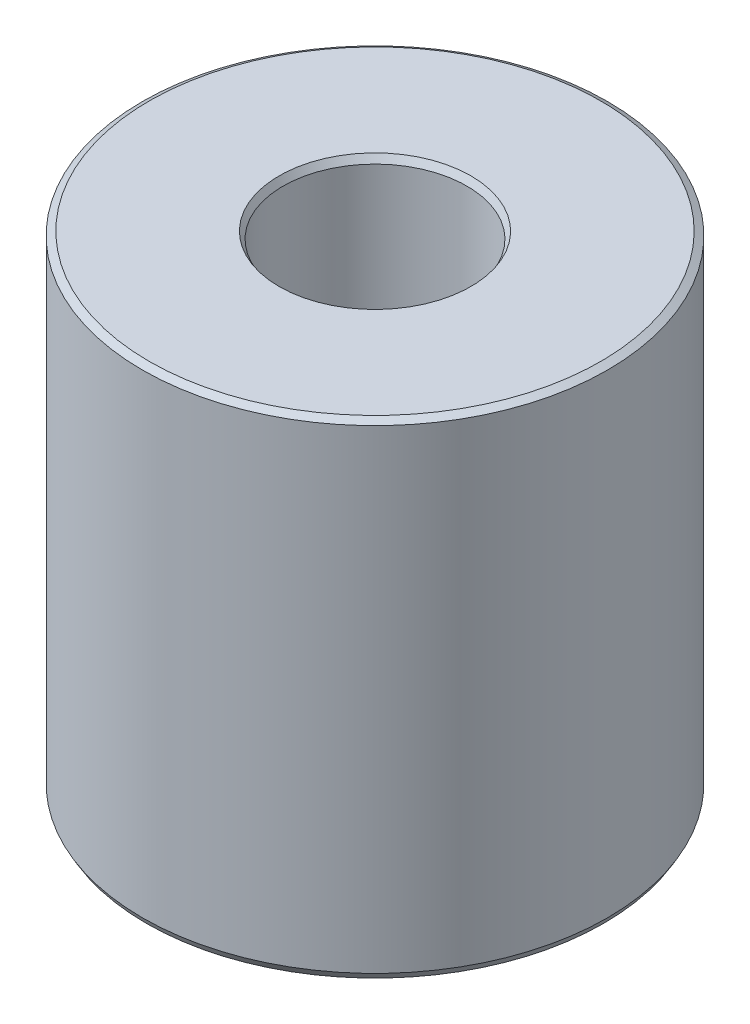
ISO-10303-21;
HEADER;
FILE_DESCRIPTION(('STEP AP214'),'2;1');
FILE_NAME('part.step','',(''),(''),'','','');
FILE_SCHEMA(('AUTOMOTIVE_DESIGN { 1 0 10303 214 1 1 1 1 }'));
ENDSEC;
DATA;
#1=APPLICATION_CONTEXT('core data for automotive mechanical design processes');
#2=APPLICATION_PROTOCOL_DEFINITION('international standard','automotive_design',2000,#1);
#3=PRODUCT_CONTEXT('',#1,'mechanical');
#4=PRODUCT('Part','Part','',(#3));
#5=PRODUCT_RELATED_PRODUCT_CATEGORY('part','',(#4));
#6=PRODUCT_DEFINITION_FORMATION('','',#4);
#7=PRODUCT_DEFINITION_CONTEXT('part definition',#1,'design');
#8=PRODUCT_DEFINITION('design','',#6,#7);
#9=PRODUCT_DEFINITION_SHAPE('','',#8);
#10=(LENGTH_UNIT() NAMED_UNIT(*) SI_UNIT(.MILLI.,.METRE.));
#11=(NAMED_UNIT(*) PLANE_ANGLE_UNIT() SI_UNIT($,.RADIAN.));
#12=(NAMED_UNIT(*) SI_UNIT($,.STERADIAN.) SOLID_ANGLE_UNIT());
#13=UNCERTAINTY_MEASURE_WITH_UNIT(LENGTH_MEASURE(1.E-05),#10,'distance_accuracy_value','');
#14=(GEOMETRIC_REPRESENTATION_CONTEXT(3) GLOBAL_UNCERTAINTY_ASSIGNED_CONTEXT((#13)) GLOBAL_UNIT_ASSIGNED_CONTEXT((#10,
#11,#12)) REPRESENTATION_CONTEXT('',''));
#15=CARTESIAN_POINT('',(0.,0.,0.));
#16=DIRECTION('',(0.,0.,1.));
#17=DIRECTION('',(1.,0.,0.));
#18=AXIS2_PLACEMENT_3D('',#15,#16,#17);
#19=CARTESIAN_POINT('',(0.,104.319641530417,0.));
#20=DIRECTION('',(0.,-1.,0.));
#21=DIRECTION('',(0.,0.,-1.));
#22=AXIS2_PLACEMENT_3D('',#19,#20,#21);
#23=CYLINDRICAL_SURFACE('',#22,50.);
#24=CARTESIAN_POINT('',(0.,1.47892764168507,0.));
#25=DIRECTION('',(0.,1.,0.));
#26=DIRECTION('',(0.,0.,1.));
#27=AXIS2_PLACEMENT_3D('',#24,#25,#26);
#28=CIRCLE('',#27,50.);
#29=CARTESIAN_POINT('',(0.,1.47892764168507,50.));
#30=VERTEX_POINT('',#29);
#31=EDGE_CURVE('E10',#30,#30,#28,.T.);
#32=ORIENTED_EDGE('',*,*,#31,.T.);
#33=EDGE_LOOP('',(#32));
#34=FACE_BOUND('',#33,.T.);
#35=CARTESIAN_POINT('',(0.,103.465782258378,0.));
#36=DIRECTION('',(0.,1.,0.));
#37=DIRECTION('',(0.,0.,1.));
#38=AXIS2_PLACEMENT_3D('',#35,#36,#37);
#39=CIRCLE('',#38,50.);
#40=CARTESIAN_POINT('',(0.,103.465782258378,50.));
#41=VERTEX_POINT('',#40);
#42=EDGE_CURVE('E50',#41,#41,#39,.F.);
#43=ORIENTED_EDGE('',*,*,#42,.T.);
#44=EDGE_LOOP('',(#43));
#45=FACE_BOUND('',#44,.T.);
#46=ADVANCED_FACE('F39',(#34,#45),#23,.T.);
#47=CARTESIAN_POINT('',(0.,104.319641530417,0.));
#48=DIRECTION('',(0.,1.,0.));
#49=DIRECTION('',(0.,0.,1.));
#50=AXIS2_PLACEMENT_3D('',#47,#48,#49);
#51=PLANE('',#50);
#52=CARTESIAN_POINT('',(0.,104.319641530417,0.));
#53=DIRECTION('',(0.,1.,0.));
#54=DIRECTION('',(0.,0.,1.));
#55=AXIS2_PLACEMENT_3D('',#52,#53,#54);
#56=CIRCLE('',#55,20.6178002502134);
#57=CARTESIAN_POINT('',(0.,104.319641530417,20.6178002502134));
#58=VERTEX_POINT('',#57);
#59=EDGE_CURVE('E58',#58,#58,#56,.F.);
#60=ORIENTED_EDGE('',*,*,#59,.T.);
#61=EDGE_LOOP('',(#60));
#62=FACE_BOUND('',#61,.T.);
#63=CARTESIAN_POINT('',(0.,104.319641530417,0.));
#64=DIRECTION('',(0.,1.,0.));
#65=DIRECTION('',(0.,0.,1.));
#66=AXIS2_PLACEMENT_3D('',#63,#64,#65);
#67=CIRCLE('',#66,48.5210723583149);
#68=CARTESIAN_POINT('',(0.,104.319641530417,48.5210723583149));
#69=VERTEX_POINT('',#68);
#70=EDGE_CURVE('E61',#69,#69,#67,.T.);
#71=ORIENTED_EDGE('',*,*,#70,.T.);
#72=EDGE_LOOP('',(#71));
#73=FACE_BOUND('',#72,.T.);
#74=ADVANCED_FACE('F88',(#62,#73),#51,.T.);
#75=CARTESIAN_POINT('',(0.,0.,0.));
#76=DIRECTION('',(0.,1.,0.));
#77=DIRECTION('',(0.,0.,1.));
#78=AXIS2_PLACEMENT_3D('',#75,#76,#77);
#79=PLANE('',#78);
#80=CARTESIAN_POINT('',(0.,0.,0.));
#81=DIRECTION('',(0.,1.,0.));
#82=DIRECTION('',(0.,0.,1.));
#83=AXIS2_PLACEMENT_3D('',#80,#81,#82);
#84=CIRCLE('',#83,21.2428686198596);
#85=CARTESIAN_POINT('',(0.,0.,21.2428686198596));
#86=VERTEX_POINT('',#85);
#87=EDGE_CURVE('E51',#86,#86,#84,.T.);
#88=ORIENTED_EDGE('',*,*,#87,.T.);
#89=EDGE_LOOP('',(#88));
#90=FACE_BOUND('',#89,.T.);
#91=CARTESIAN_POINT('',(0.,0.,0.));
#92=DIRECTION('',(0.,1.,0.));
#93=DIRECTION('',(0.,0.,1.));
#94=AXIS2_PLACEMENT_3D('',#91,#92,#93);
#95=CIRCLE('',#94,49.1461407279611);
#96=CARTESIAN_POINT('',(0.,0.,49.1461407279611));
#97=VERTEX_POINT('',#96);
#98=EDGE_CURVE('E54',#97,#97,#95,.F.);
#99=ORIENTED_EDGE('',*,*,#98,.T.);
#100=EDGE_LOOP('',(#99));
#101=FACE_BOUND('',#100,.T.);
#102=ADVANCED_FACE('F83',(#90,#101),#79,.F.);
#103=CARTESIAN_POINT('',(0.,104.319641530417,0.));
#104=DIRECTION('',(0.,-1.,0.));
#105=DIRECTION('',(0.,0.,-1.));
#106=AXIS2_PLACEMENT_3D('',#103,#104,#105);
#107=CYLINDRICAL_SURFACE('',#106,19.7639409781745);
#108=CARTESIAN_POINT('',(0.,102.840713888732,0.));
#109=DIRECTION('',(0.,1.,0.));
#110=DIRECTION('',(0.,0.,1.));
#111=AXIS2_PLACEMENT_3D('',#108,#109,#110);
#112=CIRCLE('',#111,19.7639409781745);
#113=CARTESIAN_POINT('',(0.,102.840713888732,19.7639409781745));
#114=VERTEX_POINT('',#113);
#115=EDGE_CURVE('E67',#114,#114,#112,.T.);
#116=ORIENTED_EDGE('',*,*,#115,.T.);
#117=EDGE_LOOP('',(#116));
#118=FACE_BOUND('',#117,.T.);
#119=CARTESIAN_POINT('',(0.,0.853859272038876,0.));
#120=DIRECTION('',(0.,1.,0.));
#121=DIRECTION('',(0.,0.,1.));
#122=AXIS2_PLACEMENT_3D('',#119,#120,#121);
#123=CIRCLE('',#122,19.7639409781745);
#124=CARTESIAN_POINT('',(0.,0.853859272038876,19.7639409781745));
#125=VERTEX_POINT('',#124);
#126=EDGE_CURVE('E69',#125,#125,#123,.F.);
#127=ORIENTED_EDGE('',*,*,#126,.T.);
#128=EDGE_LOOP('',(#127));
#129=FACE_BOUND('',#128,.T.);
#130=ADVANCED_FACE('F71',(#118,#129),#107,.F.);
#131=CARTESIAN_POINT('',(0.,102.840713888732,0.));
#132=DIRECTION('',(0.,1.,0.));
#133=DIRECTION('',(0.,0.,1.));
#134=AXIS2_PLACEMENT_3D('',#131,#132,#133);
#135=CONICAL_SURFACE('',#134,19.7639409781745,0.523598775598298);
#136=CARTESIAN_POINT('',(0.,104.319641530417,20.6178002502134));
#137=CARTESIAN_POINT('',(0.,104.30423603415,20.6089058827963));
#138=CARTESIAN_POINT('',(0.,104.288830537882,20.6000115153793));
#139=CARTESIAN_POINT('',(0.,104.258019545347,20.5822227805451));
#140=CARTESIAN_POINT('',(0.,104.242614049079,20.5733284131281));
#141=CARTESIAN_POINT('',(0.,104.211803056544,20.5555396782939));
#142=CARTESIAN_POINT('',(0.,104.196397560277,20.5466453108768));
#143=CARTESIAN_POINT('',(0.,104.165586567742,20.5288565760427));
#144=CARTESIAN_POINT('',(0.,104.150181071474,20.5199622086256));
#145=CARTESIAN_POINT('',(0.,104.119370078939,20.5021734737915));
#146=CARTESIAN_POINT('',(0.,104.103964582672,20.4932791063744));
#147=CARTESIAN_POINT('',(0.,104.073153590136,20.4754903715403));
#148=CARTESIAN_POINT('',(0.,104.057748093869,20.4665960041232));
#149=CARTESIAN_POINT('',(0.,104.026937101334,20.4488072692891));
#150=CARTESIAN_POINT('',(0.,104.011531605066,20.439912901872));
#151=CARTESIAN_POINT('',(0.,103.980720612531,20.4221241670378));
#152=CARTESIAN_POINT('',(0.,103.965315116264,20.4132297996208));
#153=CARTESIAN_POINT('',(0.,103.934504123728,20.3954410647866));
#154=CARTESIAN_POINT('',(0.,103.919098627461,20.3865466973696));
#155=CARTESIAN_POINT('',(0.,103.888287634926,20.3687579625354));
#156=CARTESIAN_POINT('',(0.,103.872882138658,20.3598635951183));
#157=CARTESIAN_POINT('',(0.,103.842071146123,20.3420748602842));
#158=CARTESIAN_POINT('',(0.,103.826665649856,20.3331804928671));
#159=CARTESIAN_POINT('',(0.,103.79585465732,20.315391758033));
#160=CARTESIAN_POINT('',(0.,103.780449161053,20.3064973906159));
#161=CARTESIAN_POINT('',(0.,103.749638168518,20.2887086557818));
#162=CARTESIAN_POINT('',(0.,103.73423267225,20.2798142883647));
#163=CARTESIAN_POINT('',(0.,103.703421679715,20.2620255535306));
#164=CARTESIAN_POINT('',(0.,103.688016183448,20.2531311861135));
#165=CARTESIAN_POINT('',(0.,103.657205190912,20.2353424512793));
#166=CARTESIAN_POINT('',(0.,103.641799694645,20.2264480838623));
#167=CARTESIAN_POINT('',(0.,103.61098870211,20.2086593490281));
#168=CARTESIAN_POINT('',(0.,103.595583205842,20.199764981611));
#169=CARTESIAN_POINT('',(0.,103.564772213307,20.1819762467769));
#170=CARTESIAN_POINT('',(0.,103.54936671704,20.1730818793598));
#171=CARTESIAN_POINT('',(0.,103.518555724504,20.1552931445257));
#172=CARTESIAN_POINT('',(0.,103.503150228237,20.1463987771086));
#173=CARTESIAN_POINT('',(0.,103.472339235702,20.1286100422745));
#174=CARTESIAN_POINT('',(0.,103.456933739434,20.1197156748574));
#175=CARTESIAN_POINT('',(0.,103.426122746899,20.1019269400233));
#176=CARTESIAN_POINT('',(0.,103.410717250632,20.0930325726062));
#177=CARTESIAN_POINT('',(0.,103.379906258096,20.075243837772));
#178=CARTESIAN_POINT('',(0.,103.364500761829,20.066349470355));
#179=CARTESIAN_POINT('',(0.,103.333689769294,20.0485607355208));
#180=CARTESIAN_POINT('',(0.,103.318284273026,20.0396663681038));
#181=CARTESIAN_POINT('',(0.,103.287473280491,20.0218776332696));
#182=CARTESIAN_POINT('',(0.,103.272067784224,20.0129832658525));
#183=CARTESIAN_POINT('',(0.,103.241256791689,19.9951945310184));
#184=CARTESIAN_POINT('',(0.,103.225851295421,19.9863001636013));
#185=CARTESIAN_POINT('',(0.,103.195040302886,19.9685114287672));
#186=CARTESIAN_POINT('',(0.,103.179634806618,19.9596170613501));
#187=CARTESIAN_POINT('',(0.,103.148823814083,19.941828326516));
#188=CARTESIAN_POINT('',(0.,103.133418317816,19.9329339590989));
#189=CARTESIAN_POINT('',(0.,103.102607325281,19.9151452242647));
#190=CARTESIAN_POINT('',(0.,103.087201829013,19.9062508568477));
#191=CARTESIAN_POINT('',(0.,103.056390836478,19.8884621220135));
#192=CARTESIAN_POINT('',(0.,103.04098534021,19.8795677545965));
#193=CARTESIAN_POINT('',(0.,103.010174347675,19.8617790197623));
#194=CARTESIAN_POINT('',(0.,102.994768851408,19.8528846523452));
#195=CARTESIAN_POINT('',(0.,102.963957858873,19.8350959175111));
#196=CARTESIAN_POINT('',(0.,102.948552362605,19.826201550094));
#197=CARTESIAN_POINT('',(0.,102.91774137007,19.8084128152599));
#198=CARTESIAN_POINT('',(0.,102.902335873802,19.7995184478428));
#199=CARTESIAN_POINT('',(0.,102.871524881267,19.7817297130087));
#200=CARTESIAN_POINT('',(0.,102.856119385,19.7728353455916));
#201=CARTESIAN_POINT('',(0.,102.840713888732,19.7639409781745));
#202=B_SPLINE_CURVE_WITH_KNOTS('',3,(#136,#137,#138,#139,#140,#141,#142,#143,#144,#145,#146,
#147,#148,#149,#150,#151,#152,#153,#154,#155,#156,#157,#158,#159,#160,#161,#162,#163,#164,#165,
#166,#167,#168,#169,#170,#171,#172,#173,#174,#175,#176,#177,#178,#179,#180,#181,#182,#183,#184,
#185,#186,#187,#188,#189,#190,#191,#192,#193,#194,#195,#196,#197,#198,#199,#200,#201),
.UNSPECIFIED.,.F.,.F.,(4,2,2,2,2,2,2,2,2,2,2,2,2,2,2,2,2,2,2,2,2,2,2,2,2,2,2,2,2,2,2,2,4),(0.,
0.0533662045024372,0.106732409004873,0.160098613507296,0.213464818009733,0.266831022512157,
0.320197227014594,0.373563431517017,0.426929636019453,0.48029584052189,0.533662045024313,
0.58702824952675,0.640394454029174,0.693760658531609,0.747126863034034,0.80049306753647,
0.853859272038895,0.90722547654133,0.960591681043766,1.01395788554619,1.06732409004863,
1.12069029455105,1.17405649905349,1.22742270355591,1.28078890805835,1.33415511256078,
1.38752131706321,1.44088752156564,1.49425372606807,1.5476199305705,1.60098613507293,
1.65435233957536,1.70771854407779),.UNSPECIFIED.);
#203=EDGE_CURVE('BSEAM77',#58,#114,#202,.T.);
#204=ORIENTED_EDGE('',*,*,#59,.F.);
#205=ORIENTED_EDGE('',*,*,#115,.F.);
#206=ORIENTED_EDGE('',*,*,#203,.T.);
#207=ORIENTED_EDGE('',*,*,#203,.F.);
#208=EDGE_LOOP('',(#204,#206,#205,#207));
#209=FACE_BOUND('',#208,.T.);
#210=ADVANCED_FACE('F77',(#209),#135,.F.);
#211=CARTESIAN_POINT('',(0.,0.,0.));
#212=DIRECTION('',(0.,-1.,0.));
#213=DIRECTION('',(0.,0.,-1.));
#214=AXIS2_PLACEMENT_3D('',#211,#212,#213);
#215=CONICAL_SURFACE('',#214,21.2428686198596,1.0471975511966);
#216=ORIENTED_EDGE('',*,*,#126,.F.);
#217=EDGE_LOOP('',(#216));
#218=FACE_BOUND('',#217,.T.);
#219=ORIENTED_EDGE('',*,*,#87,.F.);
#220=EDGE_LOOP('',(#219));
#221=FACE_BOUND('',#220,.T.);
#222=ADVANCED_FACE('F73',(#218,#221),#215,.F.);
#223=CARTESIAN_POINT('',(0.,1.47892764168507,0.));
#224=DIRECTION('',(0.,1.,0.));
#225=DIRECTION('',(0.,0.,1.));
#226=AXIS2_PLACEMENT_3D('',#223,#224,#225);
#227=CONICAL_SURFACE('',#226,50.,0.52359877559831);
#228=ORIENTED_EDGE('',*,*,#98,.F.);
#229=EDGE_LOOP('',(#228));
#230=FACE_BOUND('',#229,.T.);
#231=ORIENTED_EDGE('',*,*,#31,.F.);
#232=EDGE_LOOP('',(#231));
#233=FACE_BOUND('',#232,.T.);
#234=ADVANCED_FACE('F76',(#230,#233),#227,.T.);
#235=CARTESIAN_POINT('',(0.,104.319641530417,0.));
#236=DIRECTION('',(0.,-1.,0.));
#237=DIRECTION('',(0.,0.,-1.));
#238=AXIS2_PLACEMENT_3D('',#235,#236,#237);
#239=CONICAL_SURFACE('',#238,48.5210723583149,1.0471975511966);
#240=ORIENTED_EDGE('',*,*,#42,.F.);
#241=EDGE_LOOP('',(#240));
#242=FACE_BOUND('',#241,.T.);
#243=ORIENTED_EDGE('',*,*,#70,.F.);
#244=EDGE_LOOP('',(#243));
#245=FACE_BOUND('',#244,.T.);
#246=ADVANCED_FACE('F45',(#242,#245),#239,.T.);
#247=CLOSED_SHELL('',(#46,#74,#102,#130,#210,#222,#234,#246));
#248=MANIFOLD_SOLID_BREP('B2',#247);
#249=ADVANCED_BREP_SHAPE_REPRESENTATION('',(#18,#248),#14);
#250=SHAPE_DEFINITION_REPRESENTATION(#9,#249);
ENDSEC;
END-ISO-10303-21;
